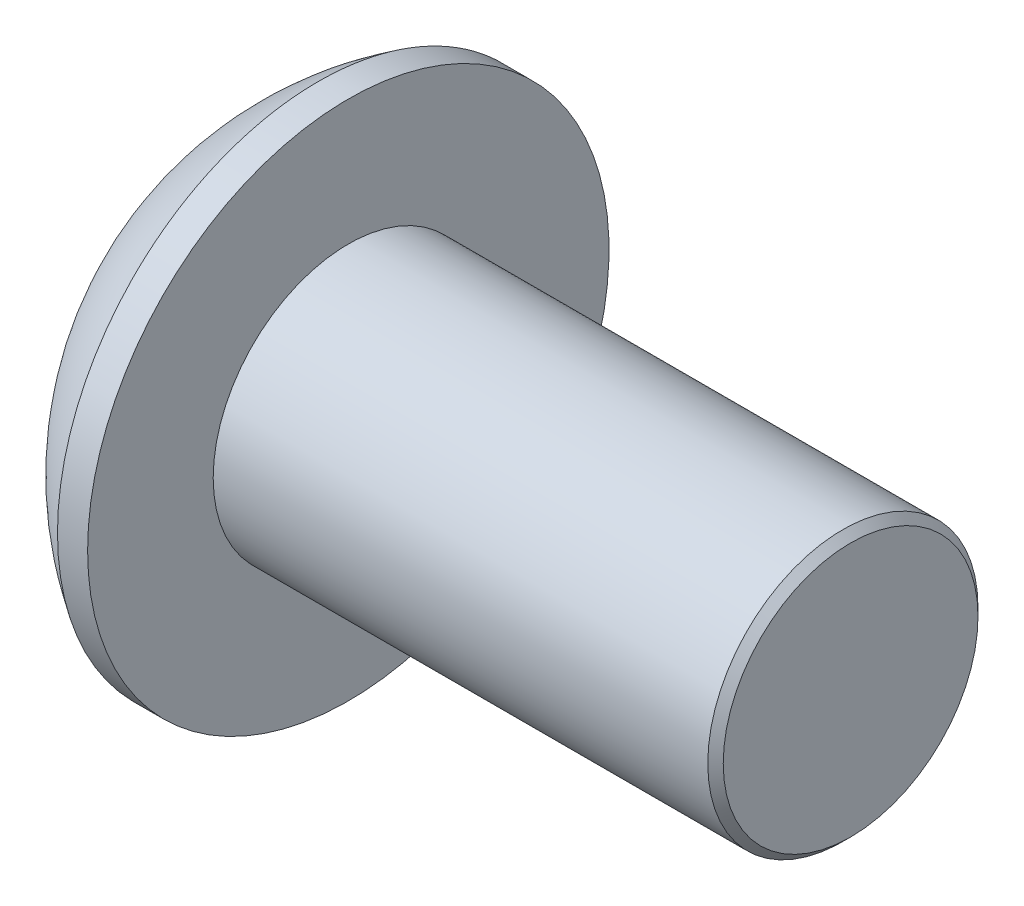
ISO-10303-21;
HEADER;
FILE_DESCRIPTION(('STEP AP214'),'2;1');
FILE_NAME('part.step','',(''),(''),'','','');
FILE_SCHEMA(('AUTOMOTIVE_DESIGN { 1 0 10303 214 1 1 1 1 }'));
ENDSEC;
DATA;
#1=APPLICATION_CONTEXT('core data for automotive mechanical design processes');
#2=APPLICATION_PROTOCOL_DEFINITION('international standard','automotive_design',2000,#1);
#3=PRODUCT_CONTEXT('',#1,'mechanical');
#4=PRODUCT('Part','Part','',(#3));
#5=PRODUCT_RELATED_PRODUCT_CATEGORY('part','',(#4));
#6=PRODUCT_DEFINITION_FORMATION('','',#4);
#7=PRODUCT_DEFINITION_CONTEXT('part definition',#1,'design');
#8=PRODUCT_DEFINITION('design','',#6,#7);
#9=PRODUCT_DEFINITION_SHAPE('','',#8);
#10=(LENGTH_UNIT() NAMED_UNIT(*) SI_UNIT(.MILLI.,.METRE.));
#11=(NAMED_UNIT(*) PLANE_ANGLE_UNIT() SI_UNIT($,.RADIAN.));
#12=(NAMED_UNIT(*) SI_UNIT($,.STERADIAN.) SOLID_ANGLE_UNIT());
#13=UNCERTAINTY_MEASURE_WITH_UNIT(LENGTH_MEASURE(1.E-05),#10,'distance_accuracy_value','');
#14=(GEOMETRIC_REPRESENTATION_CONTEXT(3) GLOBAL_UNCERTAINTY_ASSIGNED_CONTEXT((#13)) GLOBAL_UNIT_ASSIGNED_CONTEXT((#10,
#11,#12)) REPRESENTATION_CONTEXT('',''));
#15=CARTESIAN_POINT('',(0.,0.,0.));
#16=DIRECTION('',(0.,0.,1.));
#17=DIRECTION('',(1.,0.,0.));
#18=AXIS2_PLACEMENT_3D('',#15,#16,#17);
#19=CARTESIAN_POINT('',(1.32080000000034,0.,0.));
#20=DIRECTION('',(-1.,0.,0.));
#21=DIRECTION('',(0.,0.,1.));
#22=AXIS2_PLACEMENT_3D('',#19,#20,#21);
#23=CONICAL_SURFACE('',#22,1.1937999999998,1.04719755119608);
#24=CARTESIAN_POINT('',(2.01004075135902,0.,4.44089209850063E-13));
#25=VERTEX_POINT('',#24);
#26=VERTEX_LOOP('',#25);
#27=FACE_BOUND('',#26,.T.);
#28=CARTESIAN_POINT('',(1.32080000000009,0.,0.));
#29=DIRECTION('',(-1.,0.,0.));
#30=DIRECTION('',(0.,0.,1.));
#31=AXIS2_PLACEMENT_3D('',#28,#29,#30);
#32=CIRCLE('',#31,1.19380000000024);
#33=CARTESIAN_POINT('',(1.32080000000004,0.,1.19380000000012));
#34=VERTEX_POINT('',#33);
#35=CARTESIAN_POINT('',(1.32080000000004,-1.03386112703797,0.596900000000061));
#36=VERTEX_POINT('',#35);
#37=EDGE_CURVE('E20',#34,#36,#32,.F.);
#38=ORIENTED_EDGE('',*,*,#37,.F.);
#39=CARTESIAN_POINT('',(1.32080000000009,0.,0.));
#40=DIRECTION('',(-1.,0.,0.));
#41=DIRECTION('',(0.,0.,1.));
#42=AXIS2_PLACEMENT_3D('',#39,#40,#41);
#43=CIRCLE('',#42,1.19380000000024);
#44=CARTESIAN_POINT('',(1.32080000000004,1.03386112703797,0.596900000000063));
#45=VERTEX_POINT('',#44);
#46=EDGE_CURVE('E90',#45,#34,#43,.F.);
#47=ORIENTED_EDGE('',*,*,#46,.F.);
#48=CARTESIAN_POINT('',(1.32080000000009,0.,0.));
#49=DIRECTION('',(-1.,0.,0.));
#50=DIRECTION('',(0.,0.,1.));
#51=AXIS2_PLACEMENT_3D('',#48,#49,#50);
#52=CIRCLE('',#51,1.19380000000024);
#53=CARTESIAN_POINT('',(1.32080000000004,1.03386112703797,-0.596900000000063));
#54=VERTEX_POINT('',#53);
#55=EDGE_CURVE('E106',#54,#45,#52,.F.);
#56=ORIENTED_EDGE('',*,*,#55,.F.);
#57=CARTESIAN_POINT('',(1.32080000000009,0.,0.));
#58=DIRECTION('',(-1.,0.,0.));
#59=DIRECTION('',(0.,0.,1.));
#60=AXIS2_PLACEMENT_3D('',#57,#58,#59);
#61=CIRCLE('',#60,1.19380000000024);
#62=CARTESIAN_POINT('',(1.32080000000004,1.49420287879031E-12,-1.19380000000012));
#63=VERTEX_POINT('',#62);
#64=EDGE_CURVE('E487',#63,#54,#61,.F.);
#65=ORIENTED_EDGE('',*,*,#64,.F.);
#66=CARTESIAN_POINT('',(1.32080000000009,0.,0.));
#67=DIRECTION('',(-1.,0.,0.));
#68=DIRECTION('',(0.,0.,1.));
#69=AXIS2_PLACEMENT_3D('',#66,#67,#68);
#70=CIRCLE('',#69,1.19380000000024);
#71=CARTESIAN_POINT('',(1.32080000000004,-1.03386112703797,-0.596900000000062));
#72=VERTEX_POINT('',#71);
#73=EDGE_CURVE('E490',#72,#63,#70,.F.);
#74=ORIENTED_EDGE('',*,*,#73,.F.);
#75=CARTESIAN_POINT('',(1.32080000000009,0.,0.));
#76=DIRECTION('',(-1.,0.,0.));
#77=DIRECTION('',(0.,0.,1.));
#78=AXIS2_PLACEMENT_3D('',#75,#76,#77);
#79=CIRCLE('',#78,1.19380000000024);
#80=EDGE_CURVE('E93',#36,#72,#79,.F.);
#81=ORIENTED_EDGE('',*,*,#80,.F.);
#82=EDGE_LOOP('',(#38,#47,#56,#65,#74,#81));
#83=FACE_BOUND('',#82,.T.);
#84=ADVANCED_FACE('F17',(#27,#83),#23,.F.);
#85=CARTESIAN_POINT('',(1.3208,0.,2.3876));
#86=DIRECTION('',(-1.,0.,0.));
#87=DIRECTION('',(0.,0.,1.));
#88=AXIS2_PLACEMENT_3D('',#85,#86,#87);
#89=PLANE('',#88);
#90=DIRECTION('',(0.,1.,0.));
#91=VECTOR('',#90,1.);
#92=CARTESIAN_POINT('',(1.3208,-0.689240751358576,1.1938));
#93=LINE('',#92,#91);
#94=CARTESIAN_POINT('',(1.3208,-0.689240751358576,1.1938));
#95=VERTEX_POINT('',#94);
#96=EDGE_CURVE('E109',#34,#95,#93,.F.);
#97=ORIENTED_EDGE('',*,*,#96,.F.);
#98=ORIENTED_EDGE('',*,*,#37,.T.);
#99=DIRECTION('',(0.,0.5,0.866025403784439));
#100=VECTOR('',#99,1.);
#101=CARTESIAN_POINT('',(1.3208,-1.37848150271715,0.));
#102=LINE('',#101,#100);
#103=EDGE_CURVE('E112',#95,#36,#102,.F.);
#104=ORIENTED_EDGE('',*,*,#103,.F.);
#105=EDGE_LOOP('',(#97,#98,#104));
#106=FACE_BOUND('',#105,.T.);
#107=ADVANCED_FACE('F110',(#106),#89,.T.);
#108=CARTESIAN_POINT('',(1.3208,0.,2.3876));
#109=DIRECTION('',(-1.,0.,0.));
#110=DIRECTION('',(0.,0.,1.));
#111=AXIS2_PLACEMENT_3D('',#108,#109,#110);
#112=PLANE('',#111);
#113=DIRECTION('',(0.,0.5,0.866025403784439));
#114=VECTOR('',#113,1.);
#115=CARTESIAN_POINT('',(1.3208,-1.37848150271715,0.));
#116=LINE('',#115,#114);
#117=CARTESIAN_POINT('',(1.3208,-1.37848150271715,0.));
#118=VERTEX_POINT('',#117);
#119=EDGE_CURVE('E172',#36,#118,#116,.F.);
#120=ORIENTED_EDGE('',*,*,#119,.F.);
#121=ORIENTED_EDGE('',*,*,#80,.T.);
#122=DIRECTION('',(0.,-0.5,0.866025403784439));
#123=VECTOR('',#122,1.);
#124=CARTESIAN_POINT('',(1.3208,-0.689240751358576,-1.1938));
#125=LINE('',#124,#123);
#126=EDGE_CURVE('E160',#118,#72,#125,.F.);
#127=ORIENTED_EDGE('',*,*,#126,.F.);
#128=EDGE_LOOP('',(#120,#121,#127));
#129=FACE_BOUND('',#128,.T.);
#130=ADVANCED_FACE('F249',(#129),#112,.T.);
#131=CARTESIAN_POINT('',(1.3208,0.,2.3876));
#132=DIRECTION('',(-1.,0.,0.));
#133=DIRECTION('',(0.,0.,1.));
#134=AXIS2_PLACEMENT_3D('',#131,#132,#133);
#135=PLANE('',#134);
#136=DIRECTION('',(0.,-0.5,0.866025403784439));
#137=VECTOR('',#136,1.);
#138=CARTESIAN_POINT('',(1.3208,-0.689240751358576,-1.1938));
#139=LINE('',#138,#137);
#140=CARTESIAN_POINT('',(1.3208,-0.689240751358576,-1.1938));
#141=VERTEX_POINT('',#140);
#142=EDGE_CURVE('E157',#72,#141,#139,.F.);
#143=ORIENTED_EDGE('',*,*,#142,.F.);
#144=ORIENTED_EDGE('',*,*,#73,.T.);
#145=DIRECTION('',(0.,-1.,0.));
#146=VECTOR('',#145,1.);
#147=CARTESIAN_POINT('',(1.3208,0.689240751358575,-1.1938));
#148=LINE('',#147,#146);
#149=EDGE_CURVE('E144',#141,#63,#148,.F.);
#150=ORIENTED_EDGE('',*,*,#149,.F.);
#151=EDGE_LOOP('',(#143,#144,#150));
#152=FACE_BOUND('',#151,.T.);
#153=ADVANCED_FACE('F245',(#152),#135,.T.);
#154=CARTESIAN_POINT('',(1.3208,0.,2.3876));
#155=DIRECTION('',(-1.,0.,0.));
#156=DIRECTION('',(0.,0.,1.));
#157=AXIS2_PLACEMENT_3D('',#154,#155,#156);
#158=PLANE('',#157);
#159=DIRECTION('',(0.,-1.,0.));
#160=VECTOR('',#159,1.);
#161=CARTESIAN_POINT('',(1.3208,0.689240751358575,-1.1938));
#162=LINE('',#161,#160);
#163=CARTESIAN_POINT('',(1.3208,0.689240751358575,-1.1938));
#164=VERTEX_POINT('',#163);
#165=EDGE_CURVE('E141',#63,#164,#162,.F.);
#166=ORIENTED_EDGE('',*,*,#165,.F.);
#167=ORIENTED_EDGE('',*,*,#64,.T.);
#168=DIRECTION('',(0.,-0.500000000000001,-0.866025403784438));
#169=VECTOR('',#168,1.);
#170=CARTESIAN_POINT('',(1.3208,1.37848150271715,0.));
#171=LINE('',#170,#169);
#172=EDGE_CURVE('E129',#164,#54,#171,.F.);
#173=ORIENTED_EDGE('',*,*,#172,.F.);
#174=EDGE_LOOP('',(#166,#167,#173));
#175=FACE_BOUND('',#174,.T.);
#176=ADVANCED_FACE('F241',(#175),#158,.T.);
#177=CARTESIAN_POINT('',(1.3208,0.,2.3876));
#178=DIRECTION('',(-1.,0.,0.));
#179=DIRECTION('',(0.,0.,1.));
#180=AXIS2_PLACEMENT_3D('',#177,#178,#179);
#181=PLANE('',#180);
#182=DIRECTION('',(0.,-0.500000000000001,-0.866025403784438));
#183=VECTOR('',#182,1.);
#184=CARTESIAN_POINT('',(1.3208,1.37848150271715,0.));
#185=LINE('',#184,#183);
#186=CARTESIAN_POINT('',(1.3208,1.37848150271715,0.));
#187=VERTEX_POINT('',#186);
#188=EDGE_CURVE('E126',#54,#187,#185,.F.);
#189=ORIENTED_EDGE('',*,*,#188,.F.);
#190=ORIENTED_EDGE('',*,*,#55,.T.);
#191=DIRECTION('',(0.,0.500000000000001,-0.866025403784438));
#192=VECTOR('',#191,1.);
#193=CARTESIAN_POINT('',(1.3208,0.689240751358575,1.1938));
#194=LINE('',#193,#192);
#195=EDGE_CURVE('E149',#187,#45,#194,.F.);
#196=ORIENTED_EDGE('',*,*,#195,.F.);
#197=EDGE_LOOP('',(#189,#190,#196));
#198=FACE_BOUND('',#197,.T.);
#199=ADVANCED_FACE('F238',(#198),#181,.T.);
#200=CARTESIAN_POINT('',(1.3208,0.,2.3876));
#201=DIRECTION('',(-1.,0.,0.));
#202=DIRECTION('',(0.,0.,1.));
#203=AXIS2_PLACEMENT_3D('',#200,#201,#202);
#204=PLANE('',#203);
#205=DIRECTION('',(0.,0.500000000000001,-0.866025403784438));
#206=VECTOR('',#205,1.);
#207=CARTESIAN_POINT('',(1.3208,0.689240751358575,1.1938));
#208=LINE('',#207,#206);
#209=CARTESIAN_POINT('',(1.3208,0.689240751358575,1.1938));
#210=VERTEX_POINT('',#209);
#211=EDGE_CURVE('E104',#45,#210,#208,.F.);
#212=ORIENTED_EDGE('',*,*,#211,.F.);
#213=ORIENTED_EDGE('',*,*,#46,.T.);
#214=DIRECTION('',(0.,1.,0.));
#215=VECTOR('',#214,1.);
#216=CARTESIAN_POINT('',(1.3208,-0.689240751358576,1.1938));
#217=LINE('',#216,#215);
#218=EDGE_CURVE('E101',#210,#34,#217,.F.);
#219=ORIENTED_EDGE('',*,*,#218,.F.);
#220=EDGE_LOOP('',(#212,#213,#219));
#221=FACE_BOUND('',#220,.T.);
#222=ADVANCED_FACE('F99',(#221),#204,.T.);
#223=CARTESIAN_POINT('',(1.3208,-0.689240751358576,1.1938));
#224=DIRECTION('',(0.,0.,-1.));
#225=DIRECTION('',(0.,1.,0.));
#226=AXIS2_PLACEMENT_3D('',#223,#224,#225);
#227=PLANE('',#226);
#228=DIRECTION('',(0.,1.,0.));
#229=VECTOR('',#228,1.);
#230=CARTESIAN_POINT('',(0.,0.,1.1938));
#231=LINE('',#230,#229);
#232=CARTESIAN_POINT('',(0.,0.689240751358575,1.1938));
#233=VERTEX_POINT('',#232);
#234=CARTESIAN_POINT('',(0.,-0.689240751358576,1.1938));
#235=VERTEX_POINT('',#234);
#236=EDGE_CURVE('E133',#233,#235,#231,.F.);
#237=ORIENTED_EDGE('',*,*,#236,.F.);
#238=DIRECTION('',(1.,0.,0.));
#239=VECTOR('',#238,1.);
#240=CARTESIAN_POINT('',(1.3208,0.689240751358575,1.1938));
#241=LINE('',#240,#239);
#242=EDGE_CURVE('E118',#210,#233,#241,.F.);
#243=ORIENTED_EDGE('',*,*,#242,.F.);
#244=ORIENTED_EDGE('',*,*,#218,.T.);
#245=ORIENTED_EDGE('',*,*,#96,.T.);
#246=DIRECTION('',(1.,0.,0.));
#247=VECTOR('',#246,1.);
#248=CARTESIAN_POINT('',(1.3208,-0.689240751358576,1.1938));
#249=LINE('',#248,#247);
#250=EDGE_CURVE('E169',#235,#95,#249,.T.);
#251=ORIENTED_EDGE('',*,*,#250,.F.);
#252=EDGE_LOOP('',(#237,#243,#244,#245,#251));
#253=FACE_BOUND('',#252,.T.);
#254=ADVANCED_FACE('F116',(#253),#227,.T.);
#255=CARTESIAN_POINT('',(1.3208,-1.37848150271715,0.));
#256=DIRECTION('',(0.,0.866025403784439,-0.5));
#257=DIRECTION('',(0.,0.5,0.866025403784439));
#258=AXIS2_PLACEMENT_3D('',#255,#256,#257);
#259=PLANE('',#258);
#260=DIRECTION('',(0.,-0.5,-0.866025403784439));
#261=VECTOR('',#260,1.);
#262=CARTESIAN_POINT('',(0.,-0.689240751358576,1.1938));
#263=LINE('',#262,#261);
#264=CARTESIAN_POINT('',(0.,-1.37848150271715,0.));
#265=VERTEX_POINT('',#264);
#266=EDGE_CURVE('E474',#235,#265,#263,.T.);
#267=ORIENTED_EDGE('',*,*,#266,.F.);
#268=ORIENTED_EDGE('',*,*,#250,.T.);
#269=ORIENTED_EDGE('',*,*,#103,.T.);
#270=ORIENTED_EDGE('',*,*,#119,.T.);
#271=DIRECTION('',(1.,0.,0.));
#272=VECTOR('',#271,1.);
#273=CARTESIAN_POINT('',(1.3208,-1.37848150271715,0.));
#274=LINE('',#273,#272);
#275=EDGE_CURVE('E154',#265,#118,#274,.T.);
#276=ORIENTED_EDGE('',*,*,#275,.F.);
#277=EDGE_LOOP('',(#267,#268,#269,#270,#276));
#278=FACE_BOUND('',#277,.T.);
#279=ADVANCED_FACE('F229',(#278),#259,.T.);
#280=CARTESIAN_POINT('',(1.3208,-0.689240751358576,-1.1938));
#281=DIRECTION('',(0.,0.866025403784439,0.5));
#282=DIRECTION('',(0.,-0.5,0.866025403784439));
#283=AXIS2_PLACEMENT_3D('',#280,#281,#282);
#284=PLANE('',#283);
#285=DIRECTION('',(0.,0.5,-0.866025403784439));
#286=VECTOR('',#285,1.);
#287=CARTESIAN_POINT('',(0.,-1.37848150271715,0.));
#288=LINE('',#287,#286);
#289=CARTESIAN_POINT('',(0.,-0.689240751358576,-1.1938));
#290=VERTEX_POINT('',#289);
#291=EDGE_CURVE('E471',#265,#290,#288,.T.);
#292=ORIENTED_EDGE('',*,*,#291,.F.);
#293=ORIENTED_EDGE('',*,*,#275,.T.);
#294=ORIENTED_EDGE('',*,*,#126,.T.);
#295=ORIENTED_EDGE('',*,*,#142,.T.);
#296=DIRECTION('',(1.,0.,0.));
#297=VECTOR('',#296,1.);
#298=CARTESIAN_POINT('',(1.3208,-0.689240751358576,-1.1938));
#299=LINE('',#298,#297);
#300=EDGE_CURVE('E138',#290,#141,#299,.T.);
#301=ORIENTED_EDGE('',*,*,#300,.F.);
#302=EDGE_LOOP('',(#292,#293,#294,#295,#301));
#303=FACE_BOUND('',#302,.T.);
#304=ADVANCED_FACE('F225',(#303),#284,.T.);
#305=CARTESIAN_POINT('',(1.3208,0.689240751358575,-1.1938));
#306=DIRECTION('',(0.,0.,1.));
#307=DIRECTION('',(0.,-1.,0.));
#308=AXIS2_PLACEMENT_3D('',#305,#306,#307);
#309=PLANE('',#308);
#310=DIRECTION('',(0.,1.,0.));
#311=VECTOR('',#310,1.);
#312=CARTESIAN_POINT('',(0.,0.,-1.1938));
#313=LINE('',#312,#311);
#314=CARTESIAN_POINT('',(0.,0.689240751358575,-1.1938));
#315=VERTEX_POINT('',#314);
#316=EDGE_CURVE('E468',#290,#315,#313,.T.);
#317=ORIENTED_EDGE('',*,*,#316,.F.);
#318=ORIENTED_EDGE('',*,*,#300,.T.);
#319=ORIENTED_EDGE('',*,*,#149,.T.);
#320=ORIENTED_EDGE('',*,*,#165,.T.);
#321=DIRECTION('',(1.,0.,0.));
#322=VECTOR('',#321,1.);
#323=CARTESIAN_POINT('',(1.3208,0.689240751358575,-1.1938));
#324=LINE('',#323,#322);
#325=EDGE_CURVE('E128',#315,#164,#324,.T.);
#326=ORIENTED_EDGE('',*,*,#325,.F.);
#327=EDGE_LOOP('',(#317,#318,#319,#320,#326));
#328=FACE_BOUND('',#327,.T.);
#329=ADVANCED_FACE('F222',(#328),#309,.T.);
#330=CARTESIAN_POINT('',(1.3208,1.37848150271715,0.));
#331=DIRECTION('',(0.,-0.866025403784438,0.500000000000001));
#332=DIRECTION('',(0.,-0.500000000000001,-0.866025403784438));
#333=AXIS2_PLACEMENT_3D('',#330,#331,#332);
#334=PLANE('',#333);
#335=DIRECTION('',(0.,0.500000000000001,0.866025403784438));
#336=VECTOR('',#335,1.);
#337=CARTESIAN_POINT('',(0.,0.689240751358575,-1.1938));
#338=LINE('',#337,#336);
#339=CARTESIAN_POINT('',(0.,1.37848150271715,0.));
#340=VERTEX_POINT('',#339);
#341=EDGE_CURVE('E465',#315,#340,#338,.T.);
#342=ORIENTED_EDGE('',*,*,#341,.F.);
#343=ORIENTED_EDGE('',*,*,#325,.T.);
#344=ORIENTED_EDGE('',*,*,#172,.T.);
#345=ORIENTED_EDGE('',*,*,#188,.T.);
#346=DIRECTION('',(1.,0.,0.));
#347=VECTOR('',#346,1.);
#348=CARTESIAN_POINT('',(1.3208,1.37848150271715,0.));
#349=LINE('',#348,#347);
#350=EDGE_CURVE('E35',#340,#187,#349,.T.);
#351=ORIENTED_EDGE('',*,*,#350,.F.);
#352=EDGE_LOOP('',(#342,#343,#344,#345,#351));
#353=FACE_BOUND('',#352,.T.);
#354=ADVANCED_FACE('F218',(#353),#334,.T.);
#355=CARTESIAN_POINT('',(1.3208,0.689240751358575,1.1938));
#356=DIRECTION('',(0.,-0.866025403784438,-0.500000000000001));
#357=DIRECTION('',(0.,0.500000000000001,-0.866025403784438));
#358=AXIS2_PLACEMENT_3D('',#355,#356,#357);
#359=PLANE('',#358);
#360=DIRECTION('',(0.,-0.500000000000001,0.866025403784438));
#361=VECTOR('',#360,1.);
#362=CARTESIAN_POINT('',(0.,1.37848150271715,0.));
#363=LINE('',#362,#361);
#364=EDGE_CURVE('E204',#340,#233,#363,.T.);
#365=ORIENTED_EDGE('',*,*,#364,.F.);
#366=ORIENTED_EDGE('',*,*,#350,.T.);
#367=ORIENTED_EDGE('',*,*,#195,.T.);
#368=ORIENTED_EDGE('',*,*,#211,.T.);
#369=ORIENTED_EDGE('',*,*,#242,.T.);
#370=EDGE_LOOP('',(#365,#366,#367,#368,#369));
#371=FACE_BOUND('',#370,.T.);
#372=ADVANCED_FACE('F214',(#371),#359,.T.);
#373=CARTESIAN_POINT('',(0.,0.,0.));
#374=DIRECTION('',(-1.,0.,0.));
#375=DIRECTION('',(0.,0.,1.));
#376=AXIS2_PLACEMENT_3D('',#373,#374,#375);
#377=PLANE('',#376);
#378=ORIENTED_EDGE('',*,*,#341,.T.);
#379=ORIENTED_EDGE('',*,*,#364,.T.);
#380=ORIENTED_EDGE('',*,*,#236,.T.);
#381=ORIENTED_EDGE('',*,*,#266,.T.);
#382=ORIENTED_EDGE('',*,*,#291,.T.);
#383=ORIENTED_EDGE('',*,*,#316,.T.);
#384=EDGE_LOOP('',(#378,#379,#380,#381,#382,#383));
#385=FACE_BOUND('',#384,.T.);
#386=CARTESIAN_POINT('',(0.,1.647825,0.));
#387=CARTESIAN_POINT('',(1.63763925918252E-13,1.64781976319874,0.0924902039777531));
#388=CARTESIAN_POINT('',(1.32702949606854E-13,1.63999511633709,0.18514501432637));
#389=CARTESIAN_POINT('',(0.,1.6167119250047,0.322075808080014));
#390=CARTESIAN_POINT('',(-1.58596022451816E-13,1.60700618770234,0.367435533396361));
#391=CARTESIAN_POINT('',(1.5872499243493E-13,1.58380101865853,0.45722093569514));
#392=CARTESIAN_POINT('',(5.68523994290649E-13,1.5702985083103,0.501645823115263));
#393=CARTESIAN_POINT('',(9.36228728749825E-13,1.52428156574313,0.632817459278967));
#394=CARTESIAN_POINT('',(0.,1.48621992666366,0.717681965518643));
#395=CARTESIAN_POINT('',(0.,1.39637079695658,0.879809706624016));
#396=CARTESIAN_POINT('',(7.82315428745167E-13,1.34458278455109,0.957072652379993));
#397=CARTESIAN_POINT('',(4.86917074274052E-13,1.25777784714521,1.06558770210237));
#398=CARTESIAN_POINT('',(1.33283514379352E-13,1.22729946114793,1.10054993332365));
#399=CARTESIAN_POINT('',(-1.3315500899694E-13,1.16354004969106,1.16775237388221));
#400=CARTESIAN_POINT('',(0.,1.13026175473033,1.19999517515816));
#401=CARTESIAN_POINT('',(0.,1.02649304340867,1.29236218866442));
#402=CARTESIAN_POINT('',(0.,0.952049986714078,1.34814848277713));
#403=CARTESIAN_POINT('',(0.,0.794895196754069,1.44639825105766));
#404=CARTESIAN_POINT('',(0.,0.712183775431296,1.48886222758992));
#405=CARTESIAN_POINT('',(0.,0.540796624265729,1.55930919813143));
#406=CARTESIAN_POINT('',(0.,0.452120958135285,1.58729234680268));
#407=CARTESIAN_POINT('',(0.,0.271332331080316,1.62797191307413));
#408=CARTESIAN_POINT('',(0.,0.179219351801788,1.64066824903626));
#409=CARTESIAN_POINT('',(0.,-0.00583077027840854,1.65041748705409));
#410=CARTESIAN_POINT('',(0.,-0.0987679130800777,1.64747038910979));
#411=CARTESIAN_POINT('',(0.,-0.282830196388824,1.62601274134436));
#412=CARTESIAN_POINT('',(0.,-0.373955346570018,1.60750227463794));
#413=CARTESIAN_POINT('',(0.,-0.551796068178804,1.55545413364524));
#414=CARTESIAN_POINT('',(0.,-0.638511592498166,1.52191629885844));
#415=CARTESIAN_POINT('',(0.,-0.805120175533153,1.44072378052347));
#416=CARTESIAN_POINT('',(0.,-0.885012976819956,1.39306856461393));
#417=CARTESIAN_POINT('',(0.,-0.99791287958836,1.31211658756413));
#418=CARTESIAN_POINT('',(0.,-1.0343949246834,1.28354906167734));
#419=CARTESIAN_POINT('',(0.,-1.10486279842069,1.22341829303709));
#420=CARTESIAN_POINT('',(0.,-1.13884618403291,1.19185218578117));
#421=CARTESIAN_POINT('',(0.,-1.23657300939909,1.09305906467359));
#422=CARTESIAN_POINT('',(0.,-1.29619288399357,1.02166556658613));
#423=CARTESIAN_POINT('',(0.,-1.40258050817756,0.869876423478034));
#424=CARTESIAN_POINT('',(0.,-1.44934874627766,0.789481120793479));
#425=CARTESIAN_POINT('',(0.,-1.50889406070375,0.663870959313342));
#426=CARTESIAN_POINT('',(0.,-1.52698985473587,0.621110806760429));
#427=CARTESIAN_POINT('',(0.,-1.55950093966664,0.534260776864333));
#428=CARTESIAN_POINT('',(-1.05232299521477E-13,-1.57391920916438,0.49017200820317));
#429=CARTESIAN_POINT('',(2.09912830260247E-13,-1.61146177909579,0.356445777718599));
#430=CARTESIAN_POINT('',(1.14253880703177E-12,-1.62897899568075,0.265126085962908));
#431=CARTESIAN_POINT('',(4.34042593339461E-13,-1.64174347214909,0.144386595969389));
#432=CARTESIAN_POINT('',(1.21296184696852E-13,-1.64402207668916,0.115560405797875));
#433=CARTESIAN_POINT('',(-1.21296184696927E-13,-1.64706365940121,0.05782817572527));
#434=CARTESIAN_POINT('',(0.,-1.64782663757319,0.0289221358241781));
#435=CARTESIAN_POINT('',(1.63547654055969E-13,-1.64781976319875,-0.0924902039777535));
#436=CARTESIAN_POINT('',(1.3266850667884E-13,-1.6399951163371,-0.18514501432637));
#437=CARTESIAN_POINT('',(0.,-1.61671192500471,-0.322075808080013));
#438=CARTESIAN_POINT('',(-1.58598529451188E-13,-1.60700618770235,-0.36743553339636));
#439=CARTESIAN_POINT('',(1.58727501472989E-13,-1.58380101865854,-0.457220935695139));
#440=CARTESIAN_POINT('',(5.68551329349222E-13,-1.57029850831031,-0.501645823115263));
#441=CARTESIAN_POINT('',(9.36174188935675E-13,-1.52428156574314,-0.632817459278966));
#442=CARTESIAN_POINT('',(0.,-1.48621992666367,-0.717681965518643));
#443=CARTESIAN_POINT('',(0.,-1.39637079695659,-0.879809706624016));
#444=CARTESIAN_POINT('',(7.83527879222532E-13,-1.3445827845511,-0.957072652379995));
#445=CARTESIAN_POINT('',(4.87611665544768E-13,-1.25777784714522,-1.06558770210237));
#446=CARTESIAN_POINT('',(1.33494322539577E-13,-1.22729946114795,-1.10054993332365));
#447=CARTESIAN_POINT('',(-1.33365613906348E-13,-1.16354004969107,-1.16775237388221));
#448=CARTESIAN_POINT('',(0.,-1.13026175473034,-1.19999517515816));
#449=CARTESIAN_POINT('',(0.,-1.02649304340868,-1.29236218866442));
#450=CARTESIAN_POINT('',(0.,-0.952049986714089,-1.34814848277713));
#451=CARTESIAN_POINT('',(0.,-0.79489519675408,-1.44639825105766));
#452=CARTESIAN_POINT('',(0.,-0.712183775431308,-1.48886222758992));
#453=CARTESIAN_POINT('',(0.,-0.540796624265741,-1.55930919813143));
#454=CARTESIAN_POINT('',(0.,-0.452120958135297,-1.58729234680268));
#455=CARTESIAN_POINT('',(0.,-0.271332331080328,-1.62797191307413));
#456=CARTESIAN_POINT('',(0.,-0.179219351801799,-1.64066824903626));
#457=CARTESIAN_POINT('',(0.,0.00583077027839798,-1.65041748705409));
#458=CARTESIAN_POINT('',(0.,0.0987679130800672,-1.64747038910979));
#459=CARTESIAN_POINT('',(0.,0.282830196388814,-1.62601274134436));
#460=CARTESIAN_POINT('',(0.,0.373955346570008,-1.60750227463794));
#461=CARTESIAN_POINT('',(0.,0.551796068178794,-1.55545413364524));
#462=CARTESIAN_POINT('',(0.,0.638511592498155,-1.52191629885844));
#463=CARTESIAN_POINT('',(0.,0.805120175533142,-1.44072378052347));
#464=CARTESIAN_POINT('',(0.,0.885012976819945,-1.39306856461393));
#465=CARTESIAN_POINT('',(0.,0.997912879588349,-1.31211658756413));
#466=CARTESIAN_POINT('',(0.,1.03439492468339,-1.28354906167735));
#467=CARTESIAN_POINT('',(0.,1.10486279842068,-1.2234182930371));
#468=CARTESIAN_POINT('',(0.,1.1388461840329,-1.19185218578118));
#469=CARTESIAN_POINT('',(0.,1.23657300939907,-1.09305906467359));
#470=CARTESIAN_POINT('',(0.,1.29619288399356,-1.02166556658613));
#471=CARTESIAN_POINT('',(0.,1.40258050817755,-0.869876423478035));
#472=CARTESIAN_POINT('',(0.,1.44934874627765,-0.78948112079348));
#473=CARTESIAN_POINT('',(0.,1.50889406070374,-0.663870959313343));
#474=CARTESIAN_POINT('',(0.,1.52698985473586,-0.62111080676043));
#475=CARTESIAN_POINT('',(0.,1.55950093966663,-0.534260776864334));
#476=CARTESIAN_POINT('',(-1.0532011787629E-13,1.57391920916437,-0.490172008203172));
#477=CARTESIAN_POINT('',(2.10088006508332E-13,1.61146177909578,-0.3564457777186));
#478=CARTESIAN_POINT('',(1.14416805280189E-12,1.62897899568074,-0.26512608596291));
#479=CARTESIAN_POINT('',(4.34671710241649E-13,1.64174347214908,-0.144386595969391));
#480=CARTESIAN_POINT('',(1.21470371237733E-13,1.64402207668915,-0.115560405797877));
#481=CARTESIAN_POINT('',(-1.21470371237808E-13,1.6470636594012,-0.0578281757252714));
#482=CARTESIAN_POINT('',(0.,1.64782663757318,-0.0289221358241792));
#483=CARTESIAN_POINT('',(0.,1.647825,0.));
#484=B_SPLINE_CURVE_WITH_KNOTS('',3,(#386,#387,#388,#389,#390,#391,#392,#393,#394,#395,#396,
#397,#398,#399,#400,#401,#402,#403,#404,#405,#406,#407,#408,#409,#410,#411,#412,#413,#414,#415,
#416,#417,#418,#419,#420,#421,#422,#423,#424,#425,#426,#427,#428,#429,#430,#431,#432,#433,#434,
#435,#436,#437,#438,#439,#440,#441,#442,#443,#444,#445,#446,#447,#448,#449,#450,#451,#452,#453,
#454,#455,#456,#457,#458,#459,#460,#461,#462,#463,#464,#465,#466,#467,#468,#469,#470,#471,#472,
#473,#474,#475,#476,#477,#478,#479,#480,#481,#482,#483),.UNSPECIFIED.,.T.,.F.,(4,2,2,2,2,2,2,2,
2,2,2,2,2,2,2,2,2,2,2,2,2,2,2,2,2,2,2,2,2,2,2,2,2,2,2,2,2,2,2,2,2,2,2,2,2,2,2,2,4),(0.,
0.277336029422426,0.416368541537111,0.5555141146256,0.833141970294986,1.11078038089036,
1.24978149120748,1.38864858351854,1.66629367015056,1.94392828594775,2.22155993641642,
2.49919306954937,2.77682620268234,3.05445785315101,3.3320924689482,3.6097375555799,
3.74860464789074,3.88760575820768,4.16524416880333,4.44287202447288,4.58201759756161,
4.72105010967662,4.99838613909883,5.08511046196677,5.17183478483477,5.4491708142572,
5.58820332637188,5.72734889946037,6.00497675512976,6.28261516572513,6.42161627604225,
6.56048336835331,6.83812845498533,7.11576307078252,7.39339472125119,7.67102785438414,
7.94866098751711,8.22629263798579,8.50392725378297,8.78157234041467,8.92043943272551,
9.05944054304245,9.3370789536381,9.61470680930765,9.75385238239638,9.8928848945114,
10.1702209239336,10.2569452468015,10.3436695696695),.UNSPECIFIED.);
#485=CARTESIAN_POINT('',(0.,1.647825,0.));
#486=VERTEX_POINT('',#485);
#487=EDGE_CURVE('E198',#486,#486,#484,.T.);
#488=ORIENTED_EDGE('',*,*,#487,.F.);
#489=EDGE_LOOP('',(#488));
#490=FACE_BOUND('',#489,.T.);
#491=ADVANCED_FACE('F210',(#385,#490),#377,.T.);
#492=CARTESIAN_POINT('',(3.50132362607759,0.,0.));
#493=DIRECTION('',(0.,1.,0.));
#494=DIRECTION('',(1.,0.,0.));
#495=AXIS2_PLACEMENT_3D('',#492,#493,#494);
#496=SPHERICAL_SURFACE('',#495,3.86970210289554);
#497=CARTESIAN_POINT('',(1.4732,0.,0.));
#498=DIRECTION('',(-1.,0.,0.));
#499=DIRECTION('',(0.,0.,1.));
#500=AXIS2_PLACEMENT_3D('',#497,#498,#499);
#501=CIRCLE('',#500,3.29565);
#502=CARTESIAN_POINT('',(1.4732,0.,3.29565));
#503=VERTEX_POINT('',#502);
#504=EDGE_CURVE('E195',#503,#503,#501,.F.);
#505=ORIENTED_EDGE('',*,*,#504,.F.);
#506=EDGE_LOOP('',(#505));
#507=FACE_BOUND('',#506,.T.);
#508=ORIENTED_EDGE('',*,*,#487,.T.);
#509=EDGE_LOOP('',(#508));
#510=FACE_BOUND('',#509,.T.);
#511=ADVANCED_FACE('F206',(#507,#510),#496,.T.);
#512=CARTESIAN_POINT('',(8.2042,0.,0.));
#513=DIRECTION('',(-1.,0.,0.));
#514=DIRECTION('',(0.,0.,1.));
#515=AXIS2_PLACEMENT_3D('',#512,#513,#514);
#516=PLANE('',#515);
#517=CARTESIAN_POINT('',(8.20420000002287,0.,0.));
#518=DIRECTION('',(-1.,0.,0.));
#519=DIRECTION('',(0.,0.,1.));
#520=AXIS2_PLACEMENT_3D('',#517,#518,#519);
#521=CIRCLE('',#520,1.61035999991554);
#522=CARTESIAN_POINT('',(8.20420000002287,0.,1.61035999991554));
#523=VERTEX_POINT('',#522);
#524=EDGE_CURVE('E192',#523,#523,#521,.T.);
#525=ORIENTED_EDGE('',*,*,#524,.F.);
#526=EDGE_LOOP('',(#525));
#527=FACE_BOUND('',#526,.T.);
#528=ADVANCED_FACE('F277',(#527),#516,.F.);
#529=CARTESIAN_POINT('',(0.,0.,0.));
#530=DIRECTION('',(-1.,0.,0.));
#531=DIRECTION('',(0.,0.,1.));
#532=AXIS2_PLACEMENT_3D('',#529,#530,#531);
#533=CYLINDRICAL_SURFACE('',#532,3.29565);
#534=ORIENTED_EDGE('',*,*,#504,.T.);
#535=EDGE_LOOP('',(#534));
#536=FACE_BOUND('',#535,.T.);
#537=CARTESIAN_POINT('',(1.8542,0.,0.));
#538=DIRECTION('',(-1.,0.,0.));
#539=DIRECTION('',(0.,0.,1.));
#540=AXIS2_PLACEMENT_3D('',#537,#538,#539);
#541=CIRCLE('',#540,3.29565);
#542=CARTESIAN_POINT('',(1.8542,0.,3.29565));
#543=VERTEX_POINT('',#542);
#544=EDGE_CURVE('E189',#543,#543,#541,.T.);
#545=ORIENTED_EDGE('',*,*,#544,.T.);
#546=EDGE_LOOP('',(#545));
#547=FACE_BOUND('',#546,.T.);
#548=ADVANCED_FACE('F274',(#536,#547),#533,.T.);
#549=CARTESIAN_POINT('',(8.10640999998213,0.,0.));
#550=DIRECTION('',(-1.,0.,0.));
#551=DIRECTION('',(0.,0.,1.));
#552=AXIS2_PLACEMENT_3D('',#549,#550,#551);
#553=CONICAL_SURFACE('',#552,1.70815000001312,0.785398163688089);
#554=CARTESIAN_POINT('',(8.10641000000003,0.,0.));
#555=DIRECTION('',(-1.,0.,0.));
#556=DIRECTION('',(0.,0.,1.));
#557=AXIS2_PLACEMENT_3D('',#554,#555,#556);
#558=CIRCLE('',#557,1.70814999999999);
#559=CARTESIAN_POINT('',(8.10641000000003,0.,1.70814999999999));
#560=VERTEX_POINT('',#559);
#561=EDGE_CURVE('E26',#560,#560,#558,.T.);
#562=ORIENTED_EDGE('',*,*,#561,.F.);
#563=EDGE_LOOP('',(#562));
#564=FACE_BOUND('',#563,.T.);
#565=ORIENTED_EDGE('',*,*,#524,.T.);
#566=EDGE_LOOP('',(#565));
#567=FACE_BOUND('',#566,.T.);
#568=ADVANCED_FACE('F267',(#564,#567),#553,.T.);
#569=CARTESIAN_POINT('',(1.8542,1.70814999999999,0.));
#570=DIRECTION('',(-1.,0.,0.));
#571=DIRECTION('',(0.,0.,1.));
#572=AXIS2_PLACEMENT_3D('',#569,#570,#571);
#573=PLANE('',#572);
#574=CARTESIAN_POINT('',(1.8542,0.,0.));
#575=DIRECTION('',(-1.,0.,0.));
#576=DIRECTION('',(0.,0.,1.));
#577=AXIS2_PLACEMENT_3D('',#574,#575,#576);
#578=CIRCLE('',#577,1.70814999999999);
#579=CARTESIAN_POINT('',(1.8542,0.,1.70814999999999));
#580=VERTEX_POINT('',#579);
#581=EDGE_CURVE('E11',#580,#580,#578,.F.);
#582=ORIENTED_EDGE('',*,*,#581,.F.);
#583=EDGE_LOOP('',(#582));
#584=FACE_BOUND('',#583,.T.);
#585=ORIENTED_EDGE('',*,*,#544,.F.);
#586=EDGE_LOOP('',(#585));
#587=FACE_BOUND('',#586,.T.);
#588=ADVANCED_FACE('F261',(#584,#587),#573,.F.);
#589=CARTESIAN_POINT('',(0.,0.,0.));
#590=DIRECTION('',(-1.,0.,0.));
#591=DIRECTION('',(0.,0.,1.));
#592=AXIS2_PLACEMENT_3D('',#589,#590,#591);
#593=CYLINDRICAL_SURFACE('',#592,1.70814999999999);
#594=ORIENTED_EDGE('',*,*,#581,.T.);
#595=EDGE_LOOP('',(#594));
#596=FACE_BOUND('',#595,.T.);
#597=ORIENTED_EDGE('',*,*,#561,.T.);
#598=EDGE_LOOP('',(#597));
#599=FACE_BOUND('',#598,.T.);
#600=ADVANCED_FACE('F259',(#596,#599),#593,.T.);
#601=CLOSED_SHELL('',(#84,#107,#130,#153,#176,#199,#222,#254,#279,#304,#329,#354,#372,#491,#511,
#528,#548,#568,#588,#600));
#602=MANIFOLD_SOLID_BREP('B1',#601);
#603=ADVANCED_BREP_SHAPE_REPRESENTATION('',(#18,#602),#14);
#604=SHAPE_DEFINITION_REPRESENTATION(#9,#603);
ENDSEC;
END-ISO-10303-21;
